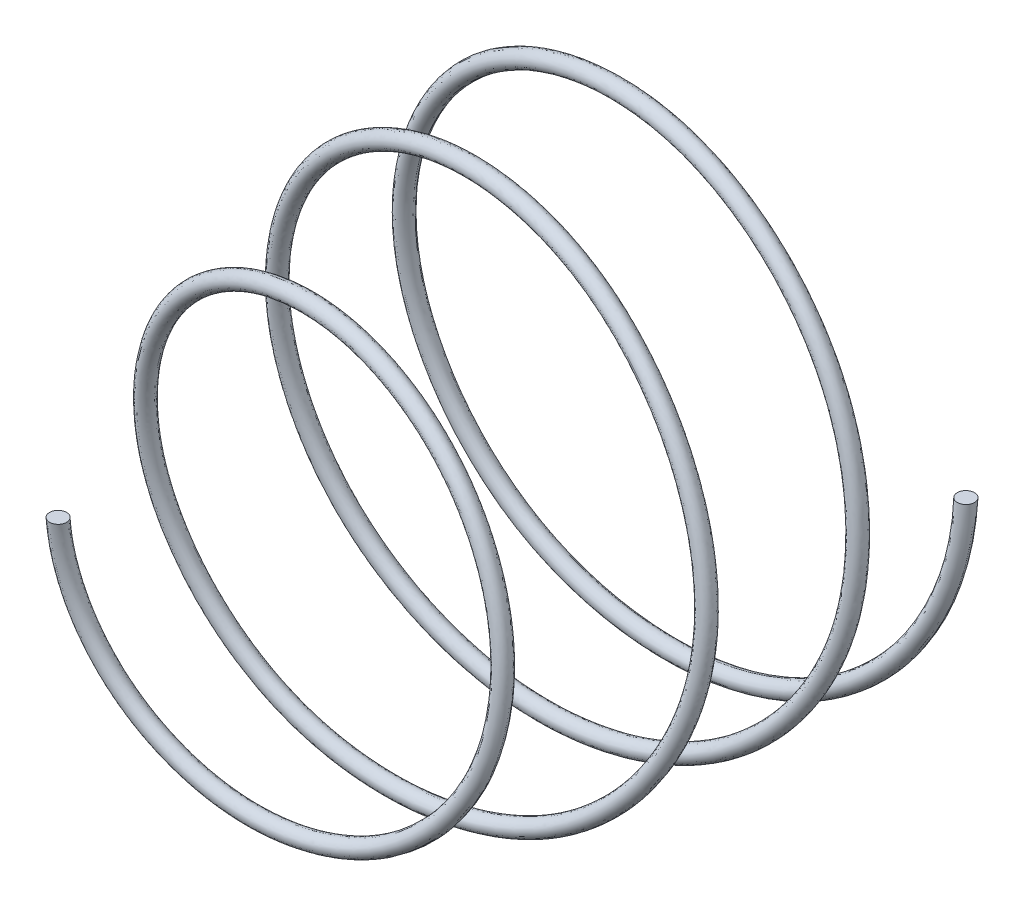
ISO-10303-21;
HEADER;
FILE_DESCRIPTION(('STEP AP214'),'2;1');
FILE_NAME('part.step','',(''),(''),'','','');
FILE_SCHEMA(('AUTOMOTIVE_DESIGN { 1 0 10303 214 1 1 1 1 }'));
ENDSEC;
DATA;
#1=APPLICATION_CONTEXT('core data for automotive mechanical design processes');
#2=APPLICATION_PROTOCOL_DEFINITION('international standard','automotive_design',2000,#1);
#3=PRODUCT_CONTEXT('',#1,'mechanical');
#4=PRODUCT('Part','Part','',(#3));
#5=PRODUCT_RELATED_PRODUCT_CATEGORY('part','',(#4));
#6=PRODUCT_DEFINITION_FORMATION('','',#4);
#7=PRODUCT_DEFINITION_CONTEXT('part definition',#1,'design');
#8=PRODUCT_DEFINITION('design','',#6,#7);
#9=PRODUCT_DEFINITION_SHAPE('','',#8);
#10=(LENGTH_UNIT() NAMED_UNIT(*) SI_UNIT(.MILLI.,.METRE.));
#11=(NAMED_UNIT(*) PLANE_ANGLE_UNIT() SI_UNIT($,.RADIAN.));
#12=(NAMED_UNIT(*) SI_UNIT($,.STERADIAN.) SOLID_ANGLE_UNIT());
#13=UNCERTAINTY_MEASURE_WITH_UNIT(LENGTH_MEASURE(1.E-05),#10,'distance_accuracy_value','');
#14=(GEOMETRIC_REPRESENTATION_CONTEXT(3) GLOBAL_UNCERTAINTY_ASSIGNED_CONTEXT((#13)) GLOBAL_UNIT_ASSIGNED_CONTEXT((#10,
#11,#12)) REPRESENTATION_CONTEXT('',''));
#15=CARTESIAN_POINT('',(0.,0.,0.));
#16=DIRECTION('',(0.,0.,1.));
#17=DIRECTION('',(1.,0.,0.));
#18=AXIS2_PLACEMENT_3D('',#15,#16,#17);
#19=CARTESIAN_POINT('',(3.,0.,0.));
#20=DIRECTION('',(0.,1.,0.));
#21=DIRECTION('',(0.,0.,1.));
#22=AXIS2_PLACEMENT_3D('',#19,#20,#21);
#23=PLANE('',#22);
#24=CARTESIAN_POINT('',(3.,0.,0.));
#25=DIRECTION('',(0.,1.,0.));
#26=DIRECTION('',(0.,0.,1.));
#27=AXIS2_PLACEMENT_3D('',#24,#25,#26);
#28=CIRCLE('',#27,0.0999999999999999);
#29=CARTESIAN_POINT('',(3.,0.,0.0999999999999999));
#30=VERTEX_POINT('',#29);
#31=EDGE_CURVE('E42',#30,#30,#28,.T.);
#32=ORIENTED_EDGE('',*,*,#31,.T.);
#33=EDGE_LOOP('',(#32));
#34=FACE_BOUND('',#33,.T.);
#35=ADVANCED_FACE('F38',(#34),#23,.T.);
#36=CARTESIAN_POINT('',(-2.1,1.02649551361988E-13,5.5));
#37=DIRECTION('',(0.,-1.,0.));
#38=DIRECTION('',(0.,0.,1.));
#39=AXIS2_PLACEMENT_3D('',#36,#37,#38);
#40=PLANE('',#39);
#41=CARTESIAN_POINT('',(-2.1,1.02649551361988E-13,5.5));
#42=DIRECTION('',(0.,-1.,0.));
#43=DIRECTION('',(0.,0.,1.));
#44=AXIS2_PLACEMENT_3D('',#41,#42,#43);
#45=CIRCLE('',#44,0.0999999999999999);
#46=CARTESIAN_POINT('',(-2.1,1.02649551361988E-13,5.6));
#47=VERTEX_POINT('',#46);
#48=EDGE_CURVE('E11',#47,#47,#45,.T.);
#49=ORIENTED_EDGE('',*,*,#48,.F.);
#50=EDGE_LOOP('',(#49));
#51=FACE_BOUND('',#50,.T.);
#52=ADVANCED_FACE('F79',(#51),#40,.F.);
#53=CARTESIAN_POINT('',(3.,0.,0.0999999999999999));
#54=CARTESIAN_POINT('',(2.99893943573948,-1.19945864909257,0.163633254270528));
#55=CARTESIAN_POINT('',(2.26141590246535,-2.24495827730856,0.225000000000012));
#56=CARTESIAN_POINT('',(0.309343025152512,-3.16948884114898,0.349999999999987));
#57=CARTESIAN_POINT('',(-0.858069160368535,-3.03935590705679,0.412499999999985));
#58=CARTESIAN_POINT('',(-2.51387042613628,-1.90838900097573,0.537500000000014));
#59=CARTESIAN_POINT('',(-2.99166666349542,-0.939532536844841,0.599999999999923));
#60=CARTESIAN_POINT('',(-2.98958333650458,0.93953253684488,0.725000000000075));
#61=CARTESIAN_POINT('',(-2.52383536970723,1.82979073821942,0.78750000000008));
#62=CARTESIAN_POINT('',(-1.11595664465713,2.90862029209121,0.912499999999918));
#63=CARTESIAN_POINT('',(-0.19218480510744,3.0959130192802,0.975000000000065));
#64=CARTESIAN_POINT('',(1.45328381503669,2.73809125305758,1.09999999999993));
#65=CARTESIAN_POINT('',(2.16476140340705,2.20292272191459,1.16249999999993));
#66=CARTESIAN_POINT('',(2.97646651153555,0.816875578736462,1.28750000000007));
#67=CARTESIAN_POINT('',(3.07674781408581,-0.0226899579926507,1.34999999999989));
#68=CARTESIAN_POINT('',(2.67930306497685,-1.50858152027044,1.47500000000011));
#69=CARTESIAN_POINT('',(2.18798393169004,-2.14837178627692,1.53750000000006));
#70=CARTESIAN_POINT('',(0.927966777340193,-2.92048914877486,1.66249999999993));
#71=CARTESIAN_POINT('',(0.166784962057753,-3.05241073871986,1.72500000000009));
#72=CARTESIAN_POINT('',(-1.23351426897467,-2.79483242778729,1.84999999999991));
#73=CARTESIAN_POINT('',(-1.86767735178331,-2.40918892074778,1.91249999999995));
#74=CARTESIAN_POINT('',(-2.73482571968324,-1.34192714345778,2.03750000000005));
#75=CARTESIAN_POINT('',(-2.96666666501538,-0.665484682180983,2.10000000000031));
#76=CARTESIAN_POINT('',(-2.96458333498463,0.665484682181117,2.22499999999969));
#77=CARTESIAN_POINT('',(-2.73263806383586,1.31594417076952,2.28750000000012));
#78=CARTESIAN_POINT('',(-1.93642374829777,2.33172450860302,2.41249999999988));
#79=CARTESIAN_POINT('',(-1.37563361890175,2.69529116691865,2.47499999999976));
#80=CARTESIAN_POINT('',(-0.164658784611858,3.01952299228008,2.60000000000024));
#81=CARTESIAN_POINT('',(0.482188493013176,2.98074741162969,2.66250000000024));
#82=CARTESIAN_POINT('',(2.19064349072477,2.32708601749865,2.84999999999952));
#83=CARTESIAN_POINT('',(2.9722916653456,1.15846277857306,2.9749999999998));
#84=CARTESIAN_POINT('',(2.931423612212,-0.965385648811021,3.20416666666683));
#85=CARTESIAN_POINT('',(2.36851985176624,-1.9001023240065,3.30833333333326));
#86=CARTESIAN_POINT('',(0.707269038493868,-2.88395233209354,3.51666666666674));
#87=CARTESIAN_POINT('',(-0.383655631251347,-2.9109885986085,3.62083333333363));
#88=CARTESIAN_POINT('',(-2.07667508609293,-1.98006422888091,3.82916666666637));
#89=CARTESIAN_POINT('',(-2.64212576016027,-1.03288439562604,3.93333333333374));
#90=CARTESIAN_POINT('',(-2.62462455435238,0.419628276364011,4.08958333333313));
#91=CARTESIAN_POINT('',(-2.48181132610865,0.902251102107171,4.14166666666663));
#92=CARTESIAN_POINT('',(-1.95828416959761,1.71928776876791,4.24583333333336));
#93=CARTESIAN_POINT('',(-1.57806748840913,2.05217328132252,4.29791666666654));
#94=CARTESIAN_POINT('',(-0.693770113991437,2.45795464461471,4.40208333333346));
#95=CARTESIAN_POINT('',(-0.191047487642285,2.52971768684621,4.4541666666663));
#96=CARTESIAN_POINT('',(0.773576208019876,2.37959228018941,4.5583333333337));
#97=CARTESIAN_POINT('',(1.23353528986769,2.15746751906624,4.61041666666629));
#98=CARTESIAN_POINT('',(1.94819923504846,1.48642760332087,4.71458333333371));
#99=CARTESIAN_POINT('',(2.20096048230321,1.03849260293051,4.7666666666664));
#100=CARTESIAN_POINT('',(2.39787352073171,0.0730164501274613,4.87083333333361));
#101=CARTESIAN_POINT('',(2.34085561055816,-0.442385695712135,4.92291666666672));
#102=CARTESIAN_POINT('',(1.92574091794239,-1.34276949725769,5.02708333333328));
#103=CARTESIAN_POINT('',(1.56797137832335,-1.7250201943906,5.07916666666652));
#104=CARTESIAN_POINT('',(0.68499714192297,-2.19202389641041,5.18333333333348));
#105=CARTESIAN_POINT('',(0.161940533937115,-2.27450193709028,5.235416666667));
#106=CARTESIAN_POINT('',(-0.828319883497029,-2.08738925968207,5.339583333333));
#107=CARTESIAN_POINT('',(-1.29197514442853,-1.81723610016765,5.3916666666662));
#108=CARTESIAN_POINT('',(-1.93847784203699,-1.03021233039892,5.4958333333338));
#109=CARTESIAN_POINT('',(-2.11776242487542,-0.516992193965065,5.54775756804655));
#110=CARTESIAN_POINT('',(-2.1,1.02649551361988E-13,5.6));
#111=CARTESIAN_POINT('',(3.05235987755983,0.,0.0999999999999999));
#112=CARTESIAN_POINT('',(3.05129931193206,-1.22039450177743,0.163633325912949));
#113=CARTESIAN_POINT('',(2.30091840642026,-2.28416460740022,0.225000000000012));
#114=CARTESIAN_POINT('',(0.314755515211678,-3.22488098052188,0.349999999999987));
#115=CARTESIAN_POINT('',(-0.873066297868183,-3.09249836484038,0.412499999999985));
#116=CARTESIAN_POINT('',(-2.55784759974763,-1.94178126305247,0.537500000000014));
#117=CARTESIAN_POINT('',(-3.04402654100071,-0.955981877231045,0.599999999999923));
#118=CARTESIAN_POINT('',(-3.04194321411896,0.955981877231085,0.725000000000075));
#119=CARTESIAN_POINT('',(-2.56805779175232,1.86184575593354,0.78750000000008));
#120=CARTESIAN_POINT('',(-1.13552637799794,2.95961217692946,0.912499999999918));
#121=CARTESIAN_POINT('',(-0.195560485642378,3.15021193157343,0.975000000000065));
#122=CARTESIAN_POINT('',(1.47878506281794,2.78614802642152,1.09999999999993));
#123=CARTESIAN_POINT('',(2.20276546647432,2.24160352379545,1.16249999999993));
#124=CARTESIAN_POINT('',(3.02875815132231,0.831231680596472,1.28750000000007));
#125=CARTESIAN_POINT('',(3.13082392926574,-0.0230841729868829,1.34999999999989));
#126=CARTESIAN_POINT('',(2.72642690589543,-1.53510934082298,1.47500000000011));
#127=CARTESIAN_POINT('',(2.22648275789266,-2.18616742299462,1.53750000000006));
#128=CARTESIAN_POINT('',(0.944308555375321,-2.9719052558982,1.66249999999993));
#129=CARTESIAN_POINT('',(0.169726750929349,-3.10617147784231,1.72500000000009));
#130=CARTESIAN_POINT('',(-1.25525019148232,-2.84409114145504,1.84999999999991));
#131=CARTESIAN_POINT('',(-1.9006033573851,-2.45166820643049,1.91249999999995));
#132=CARTESIAN_POINT('',(-2.78307411316886,-1.36560633451932,2.03750000000005));
#133=CARTESIAN_POINT('',(-3.01902654254697,-0.677234211024585,2.10000000000031));
#134=CARTESIAN_POINT('',(-3.01694321257269,0.677234211024722,2.22499999999969));
#135=CARTESIAN_POINT('',(-2.78092080281225,1.33919112357637,2.28750000000012));
#136=CARTESIAN_POINT('',(-1.97066303625897,2.37294725551964,2.41249999999988));
#137=CARTESIAN_POINT('',(-1.39996774823375,2.74296084488417,2.47499999999976));
#138=CARTESIAN_POINT('',(-0.167576869566425,3.0729648563303,2.60000000000024));
#139=CARTESIAN_POINT('',(0.490722252855258,3.03352393456592,2.66250000000024));
#140=CARTESIAN_POINT('',(2.22945638909099,2.36833688806319,2.84999999999952));
#141=CARTESIAN_POINT('',(3.02465154290308,1.1790245800108,2.9749999999998));
#142=CARTESIAN_POINT('',(2.98378348977379,-0.982520483342477,3.20416666666683));
#143=CARTESIAN_POINT('',(2.41177701112666,-1.93453899446505,3.30833333333326));
#144=CARTESIAN_POINT('',(0.720644118146694,-2.93760094199822,3.51666666666674));
#145=CARTESIAN_POINT('',(-0.390689360751117,-2.96606161430292,3.62083333333363));
#146=CARTESIAN_POINT('',(-2.11669984613355,-2.01854187151929,3.82916666666637));
#147=CARTESIAN_POINT('',(-2.69399750441175,-1.0534207236583,3.93333333333374));
#148=CARTESIAN_POINT('',(-2.6772048669131,0.427969916836899,4.08958333333313));
#149=CARTESIAN_POINT('',(-2.53190544925863,0.920392327773807,4.14166666666663));
#150=CARTESIAN_POINT('',(-1.998365215033,1.75438812537419,4.24583333333336));
#151=CARTESIAN_POINT('',(-1.61062602280596,2.09440039377581,4.29791666666654));
#152=CARTESIAN_POINT('',(-0.708321733534218,2.50925218403518,4.40208333333346));
#153=CARTESIAN_POINT('',(-0.195138502360652,2.58293031350303,4.4541666666663));
#154=CARTESIAN_POINT('',(0.79000649251283,2.43036989121744,4.5583333333337));
#155=CARTESIAN_POINT('',(1.25998610622379,2.20388253008547,4.61041666666629));
#156=CARTESIAN_POINT('',(1.99062499963396,1.51889379228058,4.71458333333371));
#157=CARTESIAN_POINT('',(2.24929475569156,1.06138613749353,4.7666666666664));
#158=CARTESIAN_POINT('',(2.45132815527124,0.0747246499579956,4.87083333333361));
#159=CARTESIAN_POINT('',(2.39348763595019,-0.452247480929685,4.92291666666672));
#160=CARTESIAN_POINT('',(1.96971363712527,-1.3733273908852,5.02708333333328));
#161=CARTESIAN_POINT('',(1.60410371620409,-1.76464093225814,5.07916666666652));
#162=CARTESIAN_POINT('',(0.70107621466077,-2.2431786823009,5.18333333333348));
#163=CARTESIAN_POINT('',(0.165847259807495,-2.32806616207426,5.235416666667));
#164=CARTESIAN_POINT('',(-0.848041472212217,-2.13734371526117,5.339583333333));
#165=CARTESIAN_POINT('',(-1.3230704551939,-1.86114305284091,5.3916666666662));
#166=CARTESIAN_POINT('',(-1.98594096277659,-1.05554987174361,5.4958333333338));
#167=CARTESIAN_POINT('',(-2.1701225385308,-0.529889374115339,5.54775687323474));
#168=CARTESIAN_POINT('',(-2.15235987755983,1.05208940857648E-13,5.6));
#169=CARTESIAN_POINT('',(3.1,0.,0.0523598775598298));
#170=CARTESIAN_POINT('',(3.09893943322176,-1.23944313595987,0.115993263069124));
#171=CARTESIAN_POINT('',(2.33686012769245,-2.31983685212341,0.177359877559857));
#172=CARTESIAN_POINT('',(0.319680119720795,-3.27528003462468,0.302359877559802));
#173=CARTESIAN_POINT('',(-0.886711583152111,-3.14085052518861,0.364859877559815));
#174=CARTESIAN_POINT('',(-2.59786064089775,-1.97216352382203,0.489859877559844));
#175=CARTESIAN_POINT('',(-3.09166666339108,-0.970948462841628,0.552359877559753));
#176=CARTESIAN_POINT('',(-3.08958333660892,0.970948462841668,0.677359877559905));
#177=CARTESIAN_POINT('',(-2.60829397447499,1.89101131246029,0.73985987755991));
#178=CARTESIAN_POINT('',(-1.15333208221119,3.00600761844652,0.864859877559748));
#179=CARTESIAN_POINT('',(-0.198631880028693,3.1996163028321,0.927359877559895));
#180=CARTESIAN_POINT('',(1.5019876107095,2.82987292941648,1.05235987755976));
#181=CARTESIAN_POINT('',(2.23734381734371,2.27679761177967,1.11485987755976));
#182=CARTESIAN_POINT('',(3.076336186989,0.844293713631169,1.2398598775599));
#183=CARTESIAN_POINT('',(3.18002558649495,-0.0234428531723363,1.30235987755972));
#184=CARTESIAN_POINT('',(2.76930297161284,-1.55924592551512,1.42735987755994));
#185=CARTESIAN_POINT('',(2.26151127361062,-2.22055613520816,1.48985987755989));
#186=CARTESIAN_POINT('',(0.959177274378613,-3.01868668001343,1.61485987755976));
#187=CARTESIAN_POINT('',(0.172403364943154,-3.15508618722718,1.67735987755992));
#188=CARTESIAN_POINT('',(-1.27502682309177,-2.88890964103415,1.80235987755974));
#189=CARTESIAN_POINT('',(-1.93056139035675,-2.4903183802928,1.8648598775597));
#190=CARTESIAN_POINT('',(-2.8269733635171,-1.38715106712811,1.98985987755996));
#191=CARTESIAN_POINT('',(-3.06666666496152,-0.687924629314504,2.05235987756014));
#192=CARTESIAN_POINT('',(-3.06458333503848,0.687924629314643,2.17735987755952));
#193=CARTESIAN_POINT('',(-2.82485130272521,1.36034258018189,2.23985987755995));
#194=CARTESIAN_POINT('',(-2.00181597142137,2.41045415587833,2.36485987755971));
#195=CARTESIAN_POINT('',(-1.42210838253005,2.78633354552441,2.42735987755959));
#196=CARTESIAN_POINT('',(-0.170231916350441,3.12158943425971,2.55235987756007));
#197=CARTESIAN_POINT('',(0.498486773757496,3.08154314568385,2.61485987756007));
#198=CARTESIAN_POINT('',(2.26477066629325,2.40586937698469,2.80235987755935));
#199=CARTESIAN_POINT('',(3.07229166534116,1.19773292662535,2.92735987755963));
#200=CARTESIAN_POINT('',(3.0314236122157,-0.998110772187935,3.15652654422666));
#201=CARTESIAN_POINT('',(2.45113494060202,-1.96587151993188,3.26069321089309));
#202=CARTESIAN_POINT('',(0.732813558985918,-2.98641362956949,3.46902654422657));
#203=CARTESIAN_POINT('',(-0.397089065070535,-3.0161703107537,3.57319321089346));
#204=CARTESIAN_POINT('',(-2.15311674697125,-2.05355111317369,3.7815265442262));
#205=CARTESIAN_POINT('',(-2.74119349421325,-1.07210589305755,3.88569321089357));
#206=CARTESIAN_POINT('',(-2.72504555419269,0.435559636141085,4.04194321089296));
#207=CARTESIAN_POINT('',(-2.57748405393882,0.936898290970262,4.09402654422646));
#208=CARTESIAN_POINT('',(-2.0348333276615,1.78632451186603,4.19819321089319));
#209=CARTESIAN_POINT('',(-1.64024970867809,2.13282112547582,4.25027654422637));
#210=CARTESIAN_POINT('',(-0.721561660154186,2.5559257282213,4.35444321089329));
#211=CARTESIAN_POINT('',(-0.198860750218561,2.63134631765412,4.40652654422613));
#212=CARTESIAN_POINT('',(0.80495573994139,2.47657037371164,4.51069321089353));
#213=CARTESIAN_POINT('',(1.28405262793037,2.24611366031471,4.56277654422612));
#214=CARTESIAN_POINT('',(2.02922647682728,1.54843345679643,4.66694321089354));
#215=CARTESIAN_POINT('',(2.29327214466933,1.08221603321712,4.71902654422623));
#216=CARTESIAN_POINT('',(2.49996435254936,0.0762788714892765,4.82319321089344));
#217=CARTESIAN_POINT('',(2.44137537463095,-0.461220318093207,4.87527654422655));
#218=CARTESIAN_POINT('',(2.00972262537232,-1.40113077511315,4.97944321089311));
#219=CARTESIAN_POINT('',(1.63697906047356,-1.80069022975731,5.03152654422635));
#220=CARTESIAN_POINT('',(0.715705908801648,-2.28972234085785,5.13569321089331));
#221=CARTESIAN_POINT('',(0.169401830740036,-2.37680207123907,5.18777654422683));
#222=CARTESIAN_POINT('',(-0.865985343452807,-2.18279524210086,5.29194321089283));
#223=CARTESIAN_POINT('',(-1.35136281341212,-1.90109220281624,5.34402654422603));
#224=CARTESIAN_POINT('',(-2.02912572540013,-1.07860346980857,5.44819321089363));
#225=CARTESIAN_POINT('',(-2.21776286070228,-0.541623987612379,5.50011616297629));
#226=CARTESIAN_POINT('',(-2.2,1.07537625236369E-13,5.55235987755983));
#227=CARTESIAN_POINT('',(3.1,0.,-0.0523598775598298));
#228=CARTESIAN_POINT('',(3.09893943322176,-1.23944313595987,0.0112735079494647));
#229=CARTESIAN_POINT('',(2.33686012769245,-2.31983685212341,0.0726401224401974));
#230=CARTESIAN_POINT('',(0.319680119720795,-3.27528003462468,0.197640122440142));
#231=CARTESIAN_POINT('',(-0.886711583152111,-3.14085052518861,0.260140122440155));
#232=CARTESIAN_POINT('',(-2.59786064089775,-1.97216352382203,0.385140122440184));
#233=CARTESIAN_POINT('',(-3.09166666339108,-0.970948462841628,0.447640122440093));
#234=CARTESIAN_POINT('',(-3.08958333660892,0.970948462841668,0.572640122440245));
#235=CARTESIAN_POINT('',(-2.60829397447499,1.89101131246029,0.635140122440251));
#236=CARTESIAN_POINT('',(-1.15333208221119,3.00600761844652,0.760140122440088));
#237=CARTESIAN_POINT('',(-0.198631880028693,3.1996163028321,0.822640122440236));
#238=CARTESIAN_POINT('',(1.5019876107095,2.82987292941648,0.947640122440104));
#239=CARTESIAN_POINT('',(2.23734381734371,2.27679761177967,1.0101401224401));
#240=CARTESIAN_POINT('',(3.076336186989,0.844293713631169,1.13514012244024));
#241=CARTESIAN_POINT('',(3.18002558649495,-0.0234428531723363,1.19764012244006));
#242=CARTESIAN_POINT('',(2.76930297161284,-1.55924592551512,1.32264012244028));
#243=CARTESIAN_POINT('',(2.26151127361062,-2.22055613520816,1.38514012244024));
#244=CARTESIAN_POINT('',(0.959177274378613,-3.01868668001343,1.5101401224401));
#245=CARTESIAN_POINT('',(0.172403364943154,-3.15508618722718,1.57264012244026));
#246=CARTESIAN_POINT('',(-1.27502682309177,-2.88890964103415,1.69764012244008));
#247=CARTESIAN_POINT('',(-1.93056139035675,-2.4903183802928,1.76014012244004));
#248=CARTESIAN_POINT('',(-2.8269733635171,-1.38715106712811,1.8851401224403));
#249=CARTESIAN_POINT('',(-3.06666666496152,-0.687924629314504,1.94764012244048));
#250=CARTESIAN_POINT('',(-3.06458333503848,0.687924629314643,2.07264012243986));
#251=CARTESIAN_POINT('',(-2.82485130272521,1.36034258018189,2.13514012244029));
#252=CARTESIAN_POINT('',(-2.00181597142137,2.41045415587833,2.26014012244005));
#253=CARTESIAN_POINT('',(-1.42210838253005,2.78633354552441,2.32264012243993));
#254=CARTESIAN_POINT('',(-0.170231916350441,3.12158943425971,2.44764012244041));
#255=CARTESIAN_POINT('',(0.498486773757496,3.08154314568385,2.51014012244041));
#256=CARTESIAN_POINT('',(2.26477066629325,2.40586937698469,2.69764012243969));
#257=CARTESIAN_POINT('',(3.07229166534116,1.19773292662535,2.82264012243997));
#258=CARTESIAN_POINT('',(3.0314236122157,-0.998110772187935,3.051806789107));
#259=CARTESIAN_POINT('',(2.45113494060202,-1.96587151993188,3.15597345577343));
#260=CARTESIAN_POINT('',(0.732813558985918,-2.98641362956949,3.36430678910691));
#261=CARTESIAN_POINT('',(-0.397089065070535,-3.0161703107537,3.4684734557738));
#262=CARTESIAN_POINT('',(-2.15311674697125,-2.05355111317369,3.67680678910654));
#263=CARTESIAN_POINT('',(-2.74119349421325,-1.07210589305755,3.78097345577391));
#264=CARTESIAN_POINT('',(-2.72504555419269,0.435559636141085,3.9372234557733));
#265=CARTESIAN_POINT('',(-2.57748405393882,0.936898290970262,3.9893067891068));
#266=CARTESIAN_POINT('',(-2.0348333276615,1.78632451186603,4.09347345577353));
#267=CARTESIAN_POINT('',(-1.64024970867809,2.13282112547582,4.14555678910671));
#268=CARTESIAN_POINT('',(-0.721561660154186,2.5559257282213,4.24972345577363));
#269=CARTESIAN_POINT('',(-0.198860750218561,2.63134631765412,4.30180678910647));
#270=CARTESIAN_POINT('',(0.80495573994139,2.47657037371164,4.40597345577387));
#271=CARTESIAN_POINT('',(1.28405262793037,2.24611366031471,4.45805678910646));
#272=CARTESIAN_POINT('',(2.02922647682728,1.54843345679643,4.56222345577388));
#273=CARTESIAN_POINT('',(2.29327214466933,1.08221603321712,4.61430678910657));
#274=CARTESIAN_POINT('',(2.49996435254936,0.0762788714892765,4.71847345577378));
#275=CARTESIAN_POINT('',(2.44137537463095,-0.461220318093207,4.77055678910689));
#276=CARTESIAN_POINT('',(2.00972262537232,-1.40113077511315,4.87472345577345));
#277=CARTESIAN_POINT('',(1.63697906047356,-1.80069022975731,4.92680678910669));
#278=CARTESIAN_POINT('',(0.715705908801648,-2.28972234085785,5.03097345577365));
#279=CARTESIAN_POINT('',(0.169401830740036,-2.37680207123907,5.08305678910717));
#280=CARTESIAN_POINT('',(-0.865985343452807,-2.18279524210086,5.18722345577317));
#281=CARTESIAN_POINT('',(-1.35136281341212,-1.90109220281624,5.23930678910637));
#282=CARTESIAN_POINT('',(-2.02912572540013,-1.07860346980857,5.34347345577397));
#283=CARTESIAN_POINT('',(-2.21776286070228,-0.541623987612379,5.39539640785663));
#284=CARTESIAN_POINT('',(-2.2,1.07537625236369E-13,5.44764012244017));
#285=CARTESIAN_POINT('',(3.05235987755983,0.,-0.0999999999999999));
#286=CARTESIAN_POINT('',(3.05129931193206,-1.22039450177743,-0.0363666740870503));
#287=CARTESIAN_POINT('',(2.30091840642026,-2.28416460740022,0.0250000000000274));
#288=CARTESIAN_POINT('',(0.314755515211678,-3.22488098052188,0.149999999999972));
#289=CARTESIAN_POINT('',(-0.873066297868183,-3.09249836484038,0.212499999999985));
#290=CARTESIAN_POINT('',(-2.55784759974763,-1.94178126305247,0.337500000000014));
#291=CARTESIAN_POINT('',(-3.04402654100071,-0.955981877231045,0.399999999999923));
#292=CARTESIAN_POINT('',(-3.04194321411896,0.955981877231085,0.525000000000075));
#293=CARTESIAN_POINT('',(-2.56805779175232,1.86184575593354,0.587500000000081));
#294=CARTESIAN_POINT('',(-1.13552637799794,2.95961217692946,0.712499999999918));
#295=CARTESIAN_POINT('',(-0.195560485642378,3.15021193157343,0.775000000000066));
#296=CARTESIAN_POINT('',(1.47878506281794,2.78614802642152,0.899999999999934));
#297=CARTESIAN_POINT('',(2.20276546647432,2.24160352379545,0.962499999999933));
#298=CARTESIAN_POINT('',(3.02875815132231,0.831231680596472,1.08750000000007));
#299=CARTESIAN_POINT('',(3.13082392926574,-0.0230841729868829,1.14999999999989));
#300=CARTESIAN_POINT('',(2.72642690589543,-1.53510934082298,1.27500000000011));
#301=CARTESIAN_POINT('',(2.22648275789266,-2.18616742299462,1.33750000000006));
#302=CARTESIAN_POINT('',(0.944308555375321,-2.9719052558982,1.46249999999993));
#303=CARTESIAN_POINT('',(0.169726750929349,-3.10617147784231,1.52500000000009));
#304=CARTESIAN_POINT('',(-1.25525019148232,-2.84409114145504,1.64999999999991));
#305=CARTESIAN_POINT('',(-1.9006033573851,-2.45166820643049,1.71249999999987));
#306=CARTESIAN_POINT('',(-2.78307411316886,-1.36560633451932,1.83750000000013));
#307=CARTESIAN_POINT('',(-3.01902654254697,-0.677234211024585,1.90000000000031));
#308=CARTESIAN_POINT('',(-3.01694321257269,0.677234211024722,2.02499999999969));
#309=CARTESIAN_POINT('',(-2.78092080281225,1.33919112357637,2.08750000000012));
#310=CARTESIAN_POINT('',(-1.97066303625897,2.37294725551964,2.21249999999988));
#311=CARTESIAN_POINT('',(-1.39996774823375,2.74296084488417,2.27499999999976));
#312=CARTESIAN_POINT('',(-0.167576869566425,3.0729648563303,2.40000000000024));
#313=CARTESIAN_POINT('',(0.490722252855258,3.03352393456592,2.46250000000024));
#314=CARTESIAN_POINT('',(2.22945638909099,2.36833688806319,2.64999999999952));
#315=CARTESIAN_POINT('',(3.02465154290308,1.1790245800108,2.7749999999998));
#316=CARTESIAN_POINT('',(2.98378348977379,-0.982520483342477,3.00416666666683));
#317=CARTESIAN_POINT('',(2.41177701112666,-1.93453899446505,3.10833333333326));
#318=CARTESIAN_POINT('',(0.720644118146694,-2.93760094199822,3.31666666666674));
#319=CARTESIAN_POINT('',(-0.390689360751117,-2.96606161430292,3.42083333333363));
#320=CARTESIAN_POINT('',(-2.11669984613355,-2.01854187151929,3.62916666666637));
#321=CARTESIAN_POINT('',(-2.69399750441175,-1.0534207236583,3.73333333333374));
#322=CARTESIAN_POINT('',(-2.6772048669131,0.427969916836899,3.88958333333313));
#323=CARTESIAN_POINT('',(-2.53190544925863,0.920392327773807,3.94166666666663));
#324=CARTESIAN_POINT('',(-1.998365215033,1.75438812537419,4.04583333333336));
#325=CARTESIAN_POINT('',(-1.61062602280596,2.09440039377581,4.09791666666654));
#326=CARTESIAN_POINT('',(-0.708321733534218,2.50925218403518,4.20208333333346));
#327=CARTESIAN_POINT('',(-0.195138502360652,2.58293031350303,4.2541666666663));
#328=CARTESIAN_POINT('',(0.79000649251283,2.43036989121744,4.3583333333337));
#329=CARTESIAN_POINT('',(1.25998610622379,2.20388253008547,4.41041666666629));
#330=CARTESIAN_POINT('',(1.99062499963396,1.51889379228058,4.51458333333371));
#331=CARTESIAN_POINT('',(2.24929475569156,1.06138613749353,4.5666666666664));
#332=CARTESIAN_POINT('',(2.45132815527124,0.0747246499579956,4.67083333333361));
#333=CARTESIAN_POINT('',(2.39348763595019,-0.452247480929685,4.72291666666672));
#334=CARTESIAN_POINT('',(1.96971363712527,-1.3733273908852,4.82708333333328));
#335=CARTESIAN_POINT('',(1.60410371620409,-1.76464093225814,4.87916666666652));
#336=CARTESIAN_POINT('',(0.70107621466077,-2.2431786823009,4.98333333333348));
#337=CARTESIAN_POINT('',(0.165847259807495,-2.32806616207426,5.035416666667));
#338=CARTESIAN_POINT('',(-0.848041472212217,-2.13734371526117,5.139583333333));
#339=CARTESIAN_POINT('',(-1.3230704551939,-1.86114305284091,5.1916666666662));
#340=CARTESIAN_POINT('',(-1.98594096277659,-1.05554987174361,5.2958333333338));
#341=CARTESIAN_POINT('',(-2.1701225385308,-0.529889374115339,5.34775687323474));
#342=CARTESIAN_POINT('',(-2.15235987755983,1.05208940857648E-13,5.4));
#343=CARTESIAN_POINT('',(2.94764012244017,0.,-0.0999999999999999));
#344=CARTESIAN_POINT('',(2.9465795595469,-1.17852279640771,-0.036366817371894));
#345=CARTESIAN_POINT('',(2.22191339851045,-2.20575194721689,0.0250000000000274));
#346=CARTESIAN_POINT('',(0.303930535093346,-3.11409670177608,0.149999999999972));
#347=CARTESIAN_POINT('',(-0.843072022868886,-2.9862134492732,0.212499999999985));
#348=CARTESIAN_POINT('',(-2.46989325252494,-1.874996738899,0.337500000000014));
#349=CARTESIAN_POINT('',(-2.93930678599014,-0.923083196458637,0.399999999999923));
#350=CARTESIAN_POINT('',(-2.9372234588902,0.923083196458675,0.525000000000075));
#351=CARTESIAN_POINT('',(-2.47961294766215,1.7977357205053,0.587500000000081));
#352=CARTESIAN_POINT('',(-1.09638691131631,2.85762840725296,0.712499999999918));
#353=CARTESIAN_POINT('',(-0.188809124572503,3.04161410698696,0.775000000000066));
#354=CARTESIAN_POINT('',(1.42778256725544,2.69003447969365,0.899999999999934));
#355=CARTESIAN_POINT('',(2.12675734033979,2.16424192003373,0.962499999999933));
#356=CARTESIAN_POINT('',(2.92417487174879,0.802519476876453,1.08750000000007));
#357=CARTESIAN_POINT('',(3.02267169890588,-0.0222957429984185,1.14999999999989));
#358=CARTESIAN_POINT('',(2.63217922405827,-1.48205369971791,1.27500000000011));
#359=CARTESIAN_POINT('',(2.14948510548743,-2.11057614955923,1.33750000000006));
#360=CARTESIAN_POINT('',(0.911624999305064,-2.86907304165151,1.46249999999993));
#361=CARTESIAN_POINT('',(0.163843173186156,-2.99864999959741,1.52500000000009));
#362=CARTESIAN_POINT('',(-1.21177834646702,-2.74557371411955,1.64999999999991));
#363=CARTESIAN_POINT('',(-1.83475134618153,-2.36670963506506,1.71249999999987));
#364=CARTESIAN_POINT('',(-2.68657732619762,-1.31824795239624,1.83750000000013));
#365=CARTESIAN_POINT('',(-2.91430678748379,-0.65373515333738,1.90000000000031));
#366=CARTESIAN_POINT('',(-2.91222345739656,0.653735153337513,2.02499999999969));
#367=CARTESIAN_POINT('',(-2.68435532485947,1.29269721796268,2.08750000000012));
#368=CARTESIAN_POINT('',(-1.90218446033658,2.2905017616864,2.21249999999988));
#369=CARTESIAN_POINT('',(-1.35129948956975,2.64762148895314,2.27499999999976));
#370=CARTESIAN_POINT('',(-0.16174069965729,2.96608112822986,2.40000000000024));
#371=CARTESIAN_POINT('',(0.473654733171094,2.92797088869347,2.46250000000024));
#372=CARTESIAN_POINT('',(2.15183059235855,2.28583514693411,2.64999999999952));
#373=CARTESIAN_POINT('',(2.91993178778812,1.13790097713531,2.7749999999998));
#374=CARTESIAN_POINT('',(2.87906373465021,-0.948250814279566,3.00416666666683));
#375=CARTESIAN_POINT('',(2.32526269240583,-1.86566565354795,3.10833333333326));
#376=CARTESIAN_POINT('',(0.693893958841042,-2.83030372218886,3.31666666666674));
#377=CARTESIAN_POINT('',(-0.376621901751576,-2.85591558291409,3.42083333333363));
#378=CARTESIAN_POINT('',(-2.0366503260523,-1.94158658624254,3.62916666666637));
#379=CARTESIAN_POINT('',(-2.59025401590879,-1.01234806759378,3.73333333333374));
#380=CARTESIAN_POINT('',(-2.57204424179166,0.411286635891123,3.88958333333313));
#381=CARTESIAN_POINT('',(-2.43171720295868,0.884109876440535,3.94166666666663));
#382=CARTESIAN_POINT('',(-1.91820312416222,1.68418741216163,4.04583333333336));
#383=CARTESIAN_POINT('',(-1.54550895401231,2.00994616886923,4.09791666666654));
#384=CARTESIAN_POINT('',(-0.679218494448655,2.40665710519424,4.20208333333346));
#385=CARTESIAN_POINT('',(-0.186956472923917,2.47650506018939,4.2541666666663));
#386=CARTESIAN_POINT('',(0.757145923526923,2.32881466916137,4.3583333333337));
#387=CARTESIAN_POINT('',(1.20708447351158,2.11105250804702,4.41041666666629));
#388=CARTESIAN_POINT('',(1.90577347046297,1.45396141436116,4.51458333333371));
#389=CARTESIAN_POINT('',(2.15262620891485,1.01559906836749,4.5666666666664));
#390=CARTESIAN_POINT('',(2.34441888619219,0.071308250296927,4.67083333333361));
#391=CARTESIAN_POINT('',(2.28822358516612,-0.432523910494585,4.72291666666672));
#392=CARTESIAN_POINT('',(1.88176819875951,-1.31221160363018,4.82708333333328));
#393=CARTESIAN_POINT('',(1.53183904044262,-1.68539945652305,4.87916666666652));
#394=CARTESIAN_POINT('',(0.668918069185169,-2.14086911051993,4.98333333333348));
#395=CARTESIAN_POINT('',(0.158033808066734,-2.2209377121063,5.035416666667));
#396=CARTESIAN_POINT('',(-0.808598294781841,-2.03743480410297,5.139583333333));
#397=CARTESIAN_POINT('',(-1.26087983366316,-1.77332914749439,5.1916666666662));
#398=CARTESIAN_POINT('',(-1.8910147212974,-1.00487478905423,5.2958333333338));
#399=CARTESIAN_POINT('',(-2.06540231122005,-0.504095013814792,5.34775826285837));
#400=CARTESIAN_POINT('',(-2.04764012244017,1.00090161866329E-13,5.4));
#401=CARTESIAN_POINT('',(2.9,0.,-0.0523598775598298));
#402=CARTESIAN_POINT('',(2.8989394384528,-1.15947406616398,0.0112732337360669));
#403=CARTESIAN_POINT('',(2.18597167723813,-2.1700797024937,0.0726401224401974));
#404=CARTESIAN_POINT('',(0.299005930584349,-3.06369764767328,0.197640122440142));
#405=CARTESIAN_POINT('',(-0.829426737585071,-2.93786128892497,0.260140122440155));
#406=CARTESIAN_POINT('',(-2.4298802113747,-1.84461447812943,0.385140122440184));
#407=CARTESIAN_POINT('',(-2.89166666359956,-0.908116610848056,0.447640122440093));
#408=CARTESIAN_POINT('',(-2.88958333640045,0.908116610848093,0.572640122440245));
#409=CARTESIAN_POINT('',(-2.43937676493958,1.76857016397855,0.635140122440251));
#410=CARTESIAN_POINT('',(-1.07858120710296,2.81123296573591,0.760140122440088));
#411=CARTESIAN_POINT('',(-0.185737730186236,2.99220973572849,0.822640122440236));
#412=CARTESIAN_POINT('',(1.40458001936393,2.6463095766985,0.947640122440104));
#413=CARTESIAN_POINT('',(2.09217898947022,2.12904783204951,1.0101401224401));
#414=CARTESIAN_POINT('',(2.87659683608228,0.789457443841756,1.13514012244024));
#415=CARTESIAN_POINT('',(2.97347004167667,-0.0219370628129654,1.19764012244006));
#416=CARTESIAN_POINT('',(2.58930315834086,-1.45791711502576,1.32264012244028));
#417=CARTESIAN_POINT('',(2.11445658976938,-2.07618743734602,1.38514012244024));
#418=CARTESIAN_POINT('',(0.896756280301856,-2.82229161753595,1.5101401224401));
#419=CARTESIAN_POINT('',(0.161166559172391,-2.94973529021254,1.57264012244026));
#420=CARTESIAN_POINT('',(-1.19200171485761,-2.70075521454043,1.69764012244008));
#421=CARTESIAN_POINT('',(-1.80479331320988,-2.32805946120268,1.76014012244004));
#422=CARTESIAN_POINT('',(-2.64267807584938,-1.29670321978754,1.8851401224403));
#423=CARTESIAN_POINT('',(-2.86666666506923,-0.643044735047462,1.94764012244048));
#424=CARTESIAN_POINT('',(-2.86458333493077,0.643044735047592,2.07264012243986));
#425=CARTESIAN_POINT('',(-2.64042482494651,1.27154576135709,2.13514012244029));
#426=CARTESIAN_POINT('',(-1.87103152517418,2.25299486132777,2.26014012244005));
#427=CARTESIAN_POINT('',(-1.32915885527342,2.60424878831275,2.32264012243993));
#428=CARTESIAN_POINT('',(-0.15908565287331,2.91745655030059,2.44764012244041));
#429=CARTESIAN_POINT('',(0.465890212268924,2.87995167757554,2.51014012244041));
#430=CARTESIAN_POINT('',(2.11651631515615,2.24830265801261,2.69764012243969));
#431=CARTESIAN_POINT('',(2.87229166535004,1.11919263052077,2.82264012243997));
#432=CARTESIAN_POINT('',(2.8314236122083,-0.932660525434108,3.051806789107));
#433=CARTESIAN_POINT('',(2.28590476293035,-1.83433312808113,3.15597345577343));
#434=CARTESIAN_POINT('',(0.681724518001927,-2.78149103461759,3.36430678910691));
#435=CARTESIAN_POINT('',(-0.370222197432049,-2.80580688646353,3.4684734557738));
#436=CARTESIAN_POINT('',(-2.00023342521472,-1.90657734458792,3.67680678910654));
#437=CARTESIAN_POINT('',(-2.54305802610685,-0.993662898194536,3.78097345577391));
#438=CARTESIAN_POINT('',(-2.5242035545123,0.403696916586937,3.9372234557733));
#439=CARTESIAN_POINT('',(-2.38613859827848,0.867603913244079,3.9893067891068));
#440=CARTESIAN_POINT('',(-1.88173501153372,1.65225102566979,4.09347345577353));
#441=CARTESIAN_POINT('',(-1.51588526814012,1.97152543716922,4.14555678910671));
#442=CARTESIAN_POINT('',(-0.665978567828742,2.35998356100812,4.24972345577363));
#443=CARTESIAN_POINT('',(-0.183234225066009,2.4280890560383,4.30180678910647));
#444=CARTESIAN_POINT('',(0.742196676098363,2.28261418666718,4.40597345577387));
#445=CARTESIAN_POINT('',(1.18301795180512,2.06882137781778,4.45805678910646));
#446=CARTESIAN_POINT('',(1.86717199326954,1.42442174984532,4.56222345577388));
#447=CARTESIAN_POINT('',(2.10864881993708,0.994769172643904,4.61430678910657));
#448=CARTESIAN_POINT('',(2.29578268891406,0.0697540287656462,4.71847345577378));
#449=CARTESIAN_POINT('',(2.24033584648525,-0.423551073331063,4.77055678910689));
#450=CARTESIAN_POINT('',(1.84175921051257,-1.28440821940223,4.87472345577345));
#451=CARTESIAN_POINT('',(1.49896369617315,-1.64935015902389,4.92680678910669));
#452=CARTESIAN_POINT('',(0.654288375044292,-2.09432545196297,5.03097345577365));
#453=CARTESIAN_POINT('',(0.154479237134208,-2.17220180294125,5.08305678910717));
#454=CARTESIAN_POINT('',(-0.790654423541265,-1.99198327726351,5.18722345577317));
#455=CARTESIAN_POINT('',(-1.23258747544494,-1.73337999751912,5.23930678910637));
#456=CARTESIAN_POINT('',(-1.84782995867385,-0.981821190989203,5.34347345577397));
#457=CARTESIAN_POINT('',(-2.01776195737175,-0.492360388187149,5.39539906628666));
#458=CARTESIAN_POINT('',(-2.,0.,5.44764012244017));
#459=CARTESIAN_POINT('',(2.9,0.,0.0523598775598298));
#460=CARTESIAN_POINT('',(2.8989394384528,-1.15947406616398,0.115992988855727));
#461=CARTESIAN_POINT('',(2.18597167723813,-2.1700797024937,0.177359877559857));
#462=CARTESIAN_POINT('',(0.299005930584349,-3.06369764767328,0.302359877559802));
#463=CARTESIAN_POINT('',(-0.829426737585071,-2.93786128892497,0.364859877559815));
#464=CARTESIAN_POINT('',(-2.4298802113747,-1.84461447812943,0.489859877559844));
#465=CARTESIAN_POINT('',(-2.89166666359956,-0.908116610848056,0.552359877559753));
#466=CARTESIAN_POINT('',(-2.88958333640045,0.908116610848093,0.677359877559905));
#467=CARTESIAN_POINT('',(-2.43937676493958,1.76857016397855,0.73985987755991));
#468=CARTESIAN_POINT('',(-1.07858120710296,2.81123296573591,0.864859877559748));
#469=CARTESIAN_POINT('',(-0.185737730186236,2.99220973572849,0.927359877559895));
#470=CARTESIAN_POINT('',(1.40458001936393,2.6463095766985,1.05235987755976));
#471=CARTESIAN_POINT('',(2.09217898947022,2.12904783204951,1.11485987755976));
#472=CARTESIAN_POINT('',(2.87659683608228,0.789457443841756,1.2398598775599));
#473=CARTESIAN_POINT('',(2.97347004167667,-0.0219370628129654,1.30235987755972));
#474=CARTESIAN_POINT('',(2.58930315834086,-1.45791711502576,1.42735987755994));
#475=CARTESIAN_POINT('',(2.11445658976938,-2.07618743734602,1.48985987755989));
#476=CARTESIAN_POINT('',(0.896756280301856,-2.82229161753595,1.61485987755976));
#477=CARTESIAN_POINT('',(0.161166559172391,-2.94973529021254,1.67735987755992));
#478=CARTESIAN_POINT('',(-1.19200171485761,-2.70075521454043,1.80235987755974));
#479=CARTESIAN_POINT('',(-1.80479331320988,-2.32805946120268,1.8648598775597));
#480=CARTESIAN_POINT('',(-2.64267807584938,-1.29670321978754,1.98985987755996));
#481=CARTESIAN_POINT('',(-2.86666666506923,-0.643044735047462,2.05235987756014));
#482=CARTESIAN_POINT('',(-2.86458333493077,0.643044735047592,2.17735987755952));
#483=CARTESIAN_POINT('',(-2.64042482494651,1.27154576135709,2.23985987755995));
#484=CARTESIAN_POINT('',(-1.87103152517418,2.25299486132777,2.36485987755971));
#485=CARTESIAN_POINT('',(-1.32915885527342,2.60424878831275,2.42735987755973));
#486=CARTESIAN_POINT('',(-0.15908565287331,2.91745655030059,2.55235987755993));
#487=CARTESIAN_POINT('',(0.465890212268924,2.87995167757554,2.61485987756007));
#488=CARTESIAN_POINT('',(2.11651631515615,2.24830265801261,2.80235987755935));
#489=CARTESIAN_POINT('',(2.87229166535004,1.11919263052077,2.92735987755963));
#490=CARTESIAN_POINT('',(2.8314236122083,-0.932660525434108,3.15652654422666));
#491=CARTESIAN_POINT('',(2.28590476293035,-1.83433312808113,3.26069321089309));
#492=CARTESIAN_POINT('',(0.681724518001927,-2.78149103461759,3.46902654422657));
#493=CARTESIAN_POINT('',(-0.370222197432049,-2.80580688646353,3.57319321089346));
#494=CARTESIAN_POINT('',(-2.00023342521472,-1.90657734458792,3.7815265442262));
#495=CARTESIAN_POINT('',(-2.54305802610685,-0.993662898194536,3.88569321089357));
#496=CARTESIAN_POINT('',(-2.5242035545123,0.403696916586937,4.04194321089296));
#497=CARTESIAN_POINT('',(-2.38613859827848,0.867603913244079,4.09402654422646));
#498=CARTESIAN_POINT('',(-1.88173501153372,1.65225102566979,4.19819321089319));
#499=CARTESIAN_POINT('',(-1.51588526814012,1.97152543716922,4.25027654422637));
#500=CARTESIAN_POINT('',(-0.665978567828742,2.35998356100812,4.35444321089329));
#501=CARTESIAN_POINT('',(-0.183234225066009,2.4280890560383,4.40652654422613));
#502=CARTESIAN_POINT('',(0.742196676098363,2.28261418666718,4.51069321089353));
#503=CARTESIAN_POINT('',(1.18301795180512,2.06882137781778,4.56277654422612));
#504=CARTESIAN_POINT('',(1.86717199326954,1.42442174984532,4.66694321089354));
#505=CARTESIAN_POINT('',(2.10864881993708,0.994769172643904,4.71902654422623));
#506=CARTESIAN_POINT('',(2.29578268891406,0.0697540287656462,4.82319321089344));
#507=CARTESIAN_POINT('',(2.24033584648525,-0.423551073331063,4.87527654422655));
#508=CARTESIAN_POINT('',(1.84175921051257,-1.28440821940223,4.97944321089311));
#509=CARTESIAN_POINT('',(1.49896369617315,-1.64935015902389,5.03152654422635));
#510=CARTESIAN_POINT('',(0.654288375044292,-2.09432545196297,5.13569321089331));
#511=CARTESIAN_POINT('',(0.154479237134208,-2.17220180294125,5.18777654422683));
#512=CARTESIAN_POINT('',(-0.790654423541265,-1.99198327726351,5.29194321089283));
#513=CARTESIAN_POINT('',(-1.23258747544494,-1.73337999751912,5.34402654422603));
#514=CARTESIAN_POINT('',(-1.84782995867385,-0.981821190989203,5.44819321089363));
#515=CARTESIAN_POINT('',(-2.01776195737175,-0.492360388187149,5.50011882140632));
#516=CARTESIAN_POINT('',(-2.,0.,5.55235987755983));
#517=CARTESIAN_POINT('',(2.94764012244017,0.,0.0999999999999999));
#518=CARTESIAN_POINT('',(2.9465795595469,-1.17852279640771,0.163633182628106));
#519=CARTESIAN_POINT('',(2.22191339851045,-2.20575194721689,0.225000000000012));
#520=CARTESIAN_POINT('',(0.303930535093346,-3.11409670177608,0.349999999999987));
#521=CARTESIAN_POINT('',(-0.843072022868886,-2.9862134492732,0.412499999999985));
#522=CARTESIAN_POINT('',(-2.46989325252494,-1.874996738899,0.537500000000014));
#523=CARTESIAN_POINT('',(-2.93930678599014,-0.923083196458637,0.599999999999923));
#524=CARTESIAN_POINT('',(-2.9372234588902,0.923083196458675,0.725000000000075));
#525=CARTESIAN_POINT('',(-2.47961294766215,1.7977357205053,0.78750000000008));
#526=CARTESIAN_POINT('',(-1.09638691131631,2.85762840725296,0.912499999999918));
#527=CARTESIAN_POINT('',(-0.188809124572503,3.04161410698696,0.975000000000065));
#528=CARTESIAN_POINT('',(1.42778256725544,2.69003447969365,1.09999999999993));
#529=CARTESIAN_POINT('',(2.12675734033979,2.16424192003373,1.16249999999993));
#530=CARTESIAN_POINT('',(2.92417487174879,0.802519476876453,1.28750000000007));
#531=CARTESIAN_POINT('',(3.02267169890588,-0.0222957429984185,1.34999999999989));
#532=CARTESIAN_POINT('',(2.63217922405827,-1.48205369971791,1.47500000000011));
#533=CARTESIAN_POINT('',(2.14948510548743,-2.11057614955923,1.53750000000006));
#534=CARTESIAN_POINT('',(0.911624999305064,-2.86907304165151,1.66249999999993));
#535=CARTESIAN_POINT('',(0.163843173186156,-2.99864999959741,1.72500000000009));
#536=CARTESIAN_POINT('',(-1.21177834646702,-2.74557371411955,1.84999999999991));
#537=CARTESIAN_POINT('',(-1.83475134618153,-2.36670963506506,1.91249999999995));
#538=CARTESIAN_POINT('',(-2.68657732619762,-1.31824795239624,2.03750000000005));
#539=CARTESIAN_POINT('',(-2.91430678748379,-0.65373515333738,2.10000000000031));
#540=CARTESIAN_POINT('',(-2.91222345739656,0.653735153337513,2.22499999999969));
#541=CARTESIAN_POINT('',(-2.68435532485947,1.29269721796268,2.28750000000012));
#542=CARTESIAN_POINT('',(-1.90218446033658,2.2905017616864,2.41249999999988));
#543=CARTESIAN_POINT('',(-1.35129948956975,2.64762148895314,2.47499999999976));
#544=CARTESIAN_POINT('',(-0.16174069965729,2.96608112822986,2.60000000000024));
#545=CARTESIAN_POINT('',(0.473654733171094,2.92797088869347,2.66250000000024));
#546=CARTESIAN_POINT('',(2.15183059235855,2.28583514693411,2.84999999999952));
#547=CARTESIAN_POINT('',(2.91993178778812,1.13790097713531,2.9749999999998));
#548=CARTESIAN_POINT('',(2.87906373465021,-0.948250814279566,3.20416666666683));
#549=CARTESIAN_POINT('',(2.32526269240583,-1.86566565354795,3.30833333333326));
#550=CARTESIAN_POINT('',(0.693893958841042,-2.83030372218886,3.51666666666674));
#551=CARTESIAN_POINT('',(-0.376621901751576,-2.85591558291409,3.62083333333363));
#552=CARTESIAN_POINT('',(-2.0366503260523,-1.94158658624254,3.82916666666637));
#553=CARTESIAN_POINT('',(-2.59025401590879,-1.01234806759378,3.93333333333374));
#554=CARTESIAN_POINT('',(-2.57204424179166,0.411286635891123,4.08958333333313));
#555=CARTESIAN_POINT('',(-2.43171720295868,0.884109876440535,4.14166666666663));
#556=CARTESIAN_POINT('',(-1.91820312416222,1.68418741216163,4.24583333333336));
#557=CARTESIAN_POINT('',(-1.54550895401231,2.00994616886923,4.29791666666654));
#558=CARTESIAN_POINT('',(-0.679218494448655,2.40665710519424,4.40208333333346));
#559=CARTESIAN_POINT('',(-0.186956472923917,2.47650506018939,4.4541666666663));
#560=CARTESIAN_POINT('',(0.757145923526923,2.32881466916137,4.5583333333337));
#561=CARTESIAN_POINT('',(1.20708447351158,2.11105250804702,4.61041666666629));
#562=CARTESIAN_POINT('',(1.90577347046297,1.45396141436116,4.71458333333371));
#563=CARTESIAN_POINT('',(2.15262620891485,1.01559906836749,4.7666666666664));
#564=CARTESIAN_POINT('',(2.34441888619219,0.071308250296927,4.87083333333361));
#565=CARTESIAN_POINT('',(2.28822358516612,-0.432523910494585,4.92291666666672));
#566=CARTESIAN_POINT('',(1.88176819875951,-1.31221160363018,5.02708333333328));
#567=CARTESIAN_POINT('',(1.53183904044262,-1.68539945652305,5.07916666666652));
#568=CARTESIAN_POINT('',(0.668918069185169,-2.14086911051993,5.18333333333348));
#569=CARTESIAN_POINT('',(0.158033808066734,-2.2209377121063,5.235416666667));
#570=CARTESIAN_POINT('',(-0.808598294781841,-2.03743480410297,5.339583333333));
#571=CARTESIAN_POINT('',(-1.26087983366316,-1.77332914749439,5.3916666666662));
#572=CARTESIAN_POINT('',(-1.8910147212974,-1.00487478905423,5.4958333333338));
#573=CARTESIAN_POINT('',(-2.06540231122005,-0.504095013814791,5.54775826285837));
#574=CARTESIAN_POINT('',(-2.04764012244017,1.00090161866329E-13,5.6));
#575=CARTESIAN_POINT('',(3.,0.,0.0999999999999999));
#576=CARTESIAN_POINT('',(2.99893943573948,-1.19945864909257,0.163633254270528));
#577=CARTESIAN_POINT('',(2.26141590246535,-2.24495827730856,0.225000000000012));
#578=CARTESIAN_POINT('',(0.309343025152512,-3.16948884114898,0.349999999999987));
#579=CARTESIAN_POINT('',(-0.858069160368535,-3.03935590705679,0.412499999999985));
#580=CARTESIAN_POINT('',(-2.51387042613628,-1.90838900097573,0.537500000000014));
#581=CARTESIAN_POINT('',(-2.99166666349542,-0.939532536844841,0.599999999999923));
#582=CARTESIAN_POINT('',(-2.98958333650458,0.93953253684488,0.725000000000075));
#583=CARTESIAN_POINT('',(-2.52383536970723,1.82979073821942,0.78750000000008));
#584=CARTESIAN_POINT('',(-1.11595664465713,2.90862029209121,0.912499999999918));
#585=CARTESIAN_POINT('',(-0.19218480510744,3.0959130192802,0.975000000000065));
#586=CARTESIAN_POINT('',(1.45328381503669,2.73809125305758,1.09999999999993));
#587=CARTESIAN_POINT('',(2.16476140340705,2.20292272191459,1.16249999999993));
#588=CARTESIAN_POINT('',(2.97646651153555,0.816875578736462,1.28750000000007));
#589=CARTESIAN_POINT('',(3.07674781408581,-0.0226899579926507,1.34999999999989));
#590=CARTESIAN_POINT('',(2.67930306497685,-1.50858152027044,1.47500000000011));
#591=CARTESIAN_POINT('',(2.18798393169004,-2.14837178627692,1.53750000000006));
#592=CARTESIAN_POINT('',(0.927966777340193,-2.92048914877486,1.66249999999993));
#593=CARTESIAN_POINT('',(0.166784962057753,-3.05241073871986,1.72500000000009));
#594=CARTESIAN_POINT('',(-1.23351426897467,-2.79483242778729,1.84999999999991));
#595=CARTESIAN_POINT('',(-1.86767735178331,-2.40918892074778,1.91249999999995));
#596=CARTESIAN_POINT('',(-2.73482571968324,-1.34192714345778,2.03750000000005));
#597=CARTESIAN_POINT('',(-2.96666666501538,-0.665484682180983,2.10000000000031));
#598=CARTESIAN_POINT('',(-2.96458333498463,0.665484682181117,2.22499999999969));
#599=CARTESIAN_POINT('',(-2.73263806383586,1.31594417076952,2.28750000000012));
#600=CARTESIAN_POINT('',(-1.93642374829777,2.33172450860302,2.41249999999988));
#601=CARTESIAN_POINT('',(-1.37563361890175,2.69529116691865,2.47499999999976));
#602=CARTESIAN_POINT('',(-0.164658784611858,3.01952299228008,2.60000000000024));
#603=CARTESIAN_POINT('',(0.482188493013176,2.98074741162969,2.66250000000024));
#604=CARTESIAN_POINT('',(2.19064349072477,2.32708601749865,2.84999999999952));
#605=CARTESIAN_POINT('',(2.9722916653456,1.15846277857306,2.9749999999998));
#606=CARTESIAN_POINT('',(2.931423612212,-0.965385648811021,3.20416666666683));
#607=CARTESIAN_POINT('',(2.36851985176624,-1.9001023240065,3.30833333333326));
#608=CARTESIAN_POINT('',(0.707269038493868,-2.88395233209354,3.51666666666674));
#609=CARTESIAN_POINT('',(-0.383655631251347,-2.9109885986085,3.62083333333363));
#610=CARTESIAN_POINT('',(-2.07667508609293,-1.98006422888091,3.82916666666637));
#611=CARTESIAN_POINT('',(-2.64212576016027,-1.03288439562604,3.93333333333374));
#612=CARTESIAN_POINT('',(-2.62462455435238,0.419628276364011,4.08958333333313));
#613=CARTESIAN_POINT('',(-2.48181132610865,0.902251102107171,4.14166666666663));
#614=CARTESIAN_POINT('',(-1.95828416959761,1.71928776876791,4.24583333333336));
#615=CARTESIAN_POINT('',(-1.57806748840913,2.05217328132252,4.29791666666654));
#616=CARTESIAN_POINT('',(-0.693770113991437,2.45795464461471,4.40208333333346));
#617=CARTESIAN_POINT('',(-0.191047487642285,2.52971768684621,4.4541666666663));
#618=CARTESIAN_POINT('',(0.773576208019876,2.37959228018941,4.5583333333337));
#619=CARTESIAN_POINT('',(1.23353528986769,2.15746751906624,4.61041666666629));
#620=CARTESIAN_POINT('',(1.94819923504846,1.48642760332087,4.71458333333371));
#621=CARTESIAN_POINT('',(2.20096048230321,1.03849260293051,4.7666666666664));
#622=CARTESIAN_POINT('',(2.39787352073171,0.0730164501274613,4.87083333333361));
#623=CARTESIAN_POINT('',(2.34085561055816,-0.442385695712135,4.92291666666672));
#624=CARTESIAN_POINT('',(1.92574091794239,-1.34276949725769,5.02708333333328));
#625=CARTESIAN_POINT('',(1.56797137832335,-1.7250201943906,5.07916666666652));
#626=CARTESIAN_POINT('',(0.68499714192297,-2.19202389641041,5.18333333333348));
#627=CARTESIAN_POINT('',(0.161940533937115,-2.27450193709028,5.235416666667));
#628=CARTESIAN_POINT('',(-0.828319883497029,-2.08738925968207,5.339583333333));
#629=CARTESIAN_POINT('',(-1.29197514442853,-1.81723610016765,5.3916666666662));
#630=CARTESIAN_POINT('',(-1.93847784203699,-1.03021233039892,5.4958333333338));
#631=CARTESIAN_POINT('',(-2.11776242487542,-0.516992193965065,5.54775756804655));
#632=CARTESIAN_POINT('',(-2.1,1.02649551361988E-13,5.6));
#633=B_SPLINE_SURFACE_WITH_KNOTS('',3,3,((#53,#54,#55,#56,#57,#58,#59,#60,#61,#62,#63,#64,#65,
#66,#67,#68,#69,#70,#71,#72,#73,#74,#75,#76,#77,#78,#79,#80,#81,#82,#83,#84,#85,#86,#87,#88,#89,
#90,#91,#92,#93,#94,#95,#96,#97,#98,#99,#100,#101,#102,#103,#104,#105,#106,#107,#108,#109,#110),
(#111,#112,#113,#114,#115,#116,#117,#118,#119,#120,#121,#122,#123,#124,#125,#126,#127,#128,#129,
#130,#131,#132,#133,#134,#135,#136,#137,#138,#139,#140,#141,#142,#143,#144,#145,#146,#147,#148,
#149,#150,#151,#152,#153,#154,#155,#156,#157,#158,#159,#160,#161,#162,#163,#164,#165,#166,#167,
#168),(#169,#170,#171,#172,#173,#174,#175,#176,#177,#178,#179,#180,#181,#182,#183,#184,#185,
#186,#187,#188,#189,#190,#191,#192,#193,#194,#195,#196,#197,#198,#199,#200,#201,#202,#203,#204,
#205,#206,#207,#208,#209,#210,#211,#212,#213,#214,#215,#216,#217,#218,#219,#220,#221,#222,#223,
#224,#225,#226),(#227,#228,#229,#230,#231,#232,#233,#234,#235,#236,#237,#238,#239,#240,#241,
#242,#243,#244,#245,#246,#247,#248,#249,#250,#251,#252,#253,#254,#255,#256,#257,#258,#259,#260,
#261,#262,#263,#264,#265,#266,#267,#268,#269,#270,#271,#272,#273,#274,#275,#276,#277,#278,#279,
#280,#281,#282,#283,#284),(#285,#286,#287,#288,#289,#290,#291,#292,#293,#294,#295,#296,#297,
#298,#299,#300,#301,#302,#303,#304,#305,#306,#307,#308,#309,#310,#311,#312,#313,#314,#315,#316,
#317,#318,#319,#320,#321,#322,#323,#324,#325,#326,#327,#328,#329,#330,#331,#332,#333,#334,#335,
#336,#337,#338,#339,#340,#341,#342),(#343,#344,#345,#346,#347,#348,#349,#350,#351,#352,#353,
#354,#355,#356,#357,#358,#359,#360,#361,#362,#363,#364,#365,#366,#367,#368,#369,#370,#371,#372,
#373,#374,#375,#376,#377,#378,#379,#380,#381,#382,#383,#384,#385,#386,#387,#388,#389,#390,#391,
#392,#393,#394,#395,#396,#397,#398,#399,#400),(#401,#402,#403,#404,#405,#406,#407,#408,#409,
#410,#411,#412,#413,#414,#415,#416,#417,#418,#419,#420,#421,#422,#423,#424,#425,#426,#427,#428,
#429,#430,#431,#432,#433,#434,#435,#436,#437,#438,#439,#440,#441,#442,#443,#444,#445,#446,#447,
#448,#449,#450,#451,#452,#453,#454,#455,#456,#457,#458),(#459,#460,#461,#462,#463,#464,#465,
#466,#467,#468,#469,#470,#471,#472,#473,#474,#475,#476,#477,#478,#479,#480,#481,#482,#483,#484,
#485,#486,#487,#488,#489,#490,#491,#492,#493,#494,#495,#496,#497,#498,#499,#500,#501,#502,#503,
#504,#505,#506,#507,#508,#509,#510,#511,#512,#513,#514,#515,#516),(#517,#518,#519,#520,#521,
#522,#523,#524,#525,#526,#527,#528,#529,#530,#531,#532,#533,#534,#535,#536,#537,#538,#539,#540,
#541,#542,#543,#544,#545,#546,#547,#548,#549,#550,#551,#552,#553,#554,#555,#556,#557,#558,#559,
#560,#561,#562,#563,#564,#565,#566,#567,#568,#569,#570,#571,#572,#573,#574),(#575,#576,#577,
#578,#579,#580,#581,#582,#583,#584,#585,#586,#587,#588,#589,#590,#591,#592,#593,#594,#595,#596,
#597,#598,#599,#600,#601,#602,#603,#604,#605,#606,#607,#608,#609,#610,#611,#612,#613,#614,#615,
#616,#617,#618,#619,#620,#621,#622,#623,#624,#625,#626,#627,#628,#629,#630,#631,#632)),
.UNSPECIFIED.,.T.,.F.,.F.,(4,2,2,2,4),(4,2,2,2,2,2,2,2,2,2,2,2,2,2,2,2,2,2,2,2,2,2,2,2,2,2,2,2,
4),(0.,0.25,0.5,0.75,1.),(0.,0.0340909090909091,0.0681818181818182,0.102272727272727,
0.136363636363636,0.170454545454545,0.204545454545455,0.238636363636364,0.272727272727273,
0.306818181818182,0.340909090909091,0.375,0.409090909090909,0.443181818181818,0.477272727272727,
0.545454545454546,0.602272727272727,0.659090909090909,0.715909090909091,0.744318181818182,
0.772727272727273,0.801136363636364,0.829545454545455,0.857954545454545,0.886363636363636,
0.914772727272727,0.943181818181818,0.971590909090909,1.),.UNSPECIFIED.);
#634=ORIENTED_EDGE('',*,*,#48,.T.);
#635=EDGE_LOOP('',(#634));
#636=FACE_BOUND('',#635,.T.);
#637=ORIENTED_EDGE('',*,*,#31,.F.);
#638=EDGE_LOOP('',(#637));
#639=FACE_BOUND('',#638,.T.);
#640=ADVANCED_FACE('F58',(#636,#639),#633,.F.);
#641=CLOSED_SHELL('',(#35,#52,#640));
#642=MANIFOLD_SOLID_BREP('B2',#641);
#643=ADVANCED_BREP_SHAPE_REPRESENTATION('',(#18,#642),#14);
#644=SHAPE_DEFINITION_REPRESENTATION(#9,#643);
ENDSEC;
END-ISO-10303-21;
